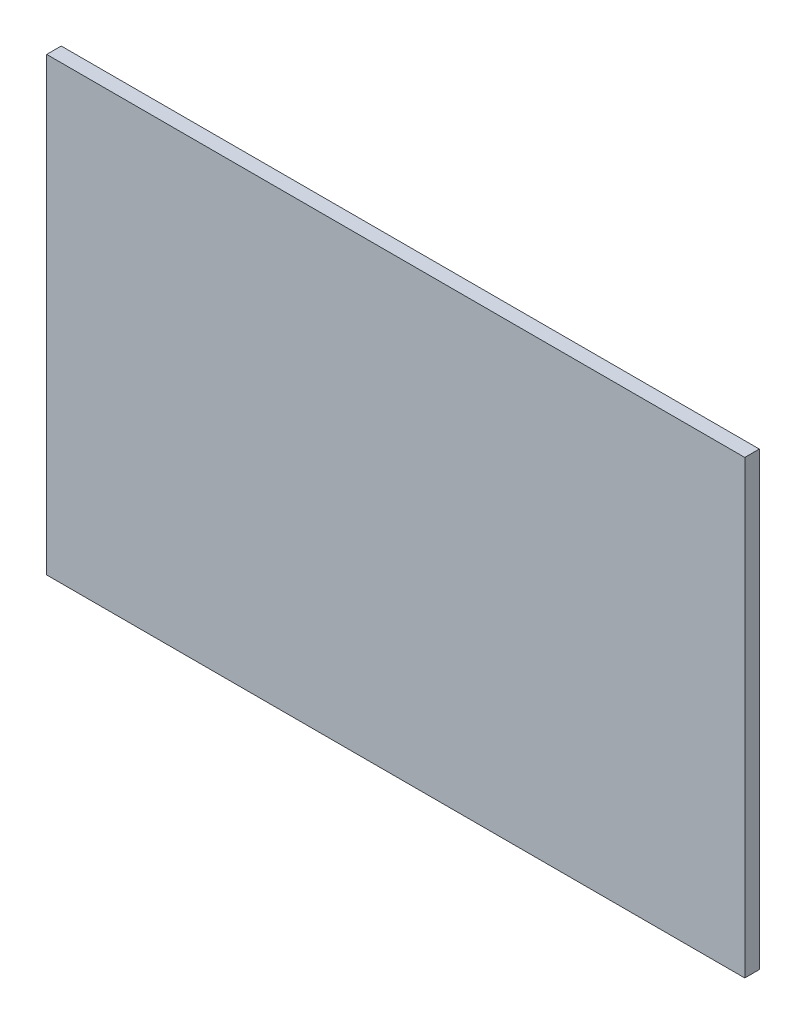
ISO-10303-21;
HEADER;
FILE_DESCRIPTION(('STEP AP214'),'2;1');
FILE_NAME('part.step','',(''),(''),'','','');
FILE_SCHEMA(('AUTOMOTIVE_DESIGN { 1 0 10303 214 1 1 1 1 }'));
ENDSEC;
DATA;
#1=APPLICATION_CONTEXT('core data for automotive mechanical design processes');
#2=APPLICATION_PROTOCOL_DEFINITION('international standard','automotive_design',2000,#1);
#3=PRODUCT_CONTEXT('',#1,'mechanical');
#4=PRODUCT('Part','Part','',(#3));
#5=PRODUCT_RELATED_PRODUCT_CATEGORY('part','',(#4));
#6=PRODUCT_DEFINITION_FORMATION('','',#4);
#7=PRODUCT_DEFINITION_CONTEXT('part definition',#1,'design');
#8=PRODUCT_DEFINITION('design','',#6,#7);
#9=PRODUCT_DEFINITION_SHAPE('','',#8);
#10=(LENGTH_UNIT() NAMED_UNIT(*) SI_UNIT(.MILLI.,.METRE.));
#11=(NAMED_UNIT(*) PLANE_ANGLE_UNIT() SI_UNIT($,.RADIAN.));
#12=(NAMED_UNIT(*) SI_UNIT($,.STERADIAN.) SOLID_ANGLE_UNIT());
#13=UNCERTAINTY_MEASURE_WITH_UNIT(LENGTH_MEASURE(1.E-05),#10,'distance_accuracy_value','');
#14=(GEOMETRIC_REPRESENTATION_CONTEXT(3) GLOBAL_UNCERTAINTY_ASSIGNED_CONTEXT((#13)) GLOBAL_UNIT_ASSIGNED_CONTEXT((#10,
#11,#12)) REPRESENTATION_CONTEXT('',''));
#15=CARTESIAN_POINT('',(0.,0.,0.));
#16=DIRECTION('',(0.,0.,1.));
#17=DIRECTION('',(1.,0.,0.));
#18=AXIS2_PLACEMENT_3D('',#15,#16,#17);
#19=CARTESIAN_POINT('',(-42.6888138682352,28.2641509433962,2.));
#20=DIRECTION('',(1.,0.,0.));
#21=DIRECTION('',(0.,1.,0.));
#22=AXIS2_PLACEMENT_3D('',#19,#20,#21);
#23=PLANE('',#22);
#24=DIRECTION('',(0.,-1.,0.));
#25=VECTOR('',#24,1.);
#26=CARTESIAN_POINT('',(-42.6888138682352,28.2641509433962,0.));
#27=LINE('',#26,#25);
#28=CARTESIAN_POINT('',(-42.6888138682352,28.2641509433962,0.));
#29=VERTEX_POINT('',#28);
#30=CARTESIAN_POINT('',(-42.6888138682352,-33.7358490566038,0.));
#31=VERTEX_POINT('',#30);
#32=EDGE_CURVE('E96',#29,#31,#27,.T.);
#33=ORIENTED_EDGE('',*,*,#32,.T.);
#34=DIRECTION('',(0.,0.,-1.));
#35=VECTOR('',#34,1.);
#36=CARTESIAN_POINT('',(-42.6888138682352,-33.7358490566038,2.));
#37=LINE('',#36,#35);
#38=CARTESIAN_POINT('',(-42.6888138682352,-33.7358490566038,2.));
#39=VERTEX_POINT('',#38);
#40=EDGE_CURVE('E11',#39,#31,#37,.T.);
#41=ORIENTED_EDGE('',*,*,#40,.F.);
#42=DIRECTION('',(0.,-1.,0.));
#43=VECTOR('',#42,1.);
#44=CARTESIAN_POINT('',(-42.6888138682352,28.2641509433962,2.));
#45=LINE('',#44,#43);
#46=CARTESIAN_POINT('',(-42.6888138682352,28.2641509433962,2.));
#47=VERTEX_POINT('',#46);
#48=EDGE_CURVE('E84',#47,#39,#45,.T.);
#49=ORIENTED_EDGE('',*,*,#48,.F.);
#50=DIRECTION('',(0.,0.,-1.));
#51=VECTOR('',#50,1.);
#52=CARTESIAN_POINT('',(-42.6888138682352,28.2641509433962,2.));
#53=LINE('',#52,#51);
#54=EDGE_CURVE('E92',#47,#29,#53,.T.);
#55=ORIENTED_EDGE('',*,*,#54,.T.);
#56=EDGE_LOOP('',(#33,#41,#49,#55));
#57=FACE_BOUND('',#56,.T.);
#58=ADVANCED_FACE('F33',(#57),#23,.F.);
#59=CARTESIAN_POINT('',(-42.6888138682352,-33.7358490566038,2.));
#60=DIRECTION('',(0.,1.,0.));
#61=DIRECTION('',(0.,0.,1.));
#62=AXIS2_PLACEMENT_3D('',#59,#60,#61);
#63=PLANE('',#62);
#64=DIRECTION('',(1.,0.,0.));
#65=VECTOR('',#64,1.);
#66=CARTESIAN_POINT('',(-42.6888138682352,-33.7358490566038,0.));
#67=LINE('',#66,#65);
#68=CARTESIAN_POINT('',(53.3111861317648,-33.7358490566038,0.));
#69=VERTEX_POINT('',#68);
#70=EDGE_CURVE('E88',#31,#69,#67,.T.);
#71=ORIENTED_EDGE('',*,*,#70,.T.);
#72=DIRECTION('',(0.,0.,-1.));
#73=VECTOR('',#72,1.);
#74=CARTESIAN_POINT('',(53.3111861317648,-33.7358490566038,2.));
#75=LINE('',#74,#73);
#76=CARTESIAN_POINT('',(53.3111861317648,-33.7358490566038,2.));
#77=VERTEX_POINT('',#76);
#78=EDGE_CURVE('E41',#77,#69,#75,.T.);
#79=ORIENTED_EDGE('',*,*,#78,.F.);
#80=DIRECTION('',(1.,0.,0.));
#81=VECTOR('',#80,1.);
#82=CARTESIAN_POINT('',(-42.6888138682352,-33.7358490566038,2.));
#83=LINE('',#82,#81);
#84=EDGE_CURVE('E79',#39,#77,#83,.T.);
#85=ORIENTED_EDGE('',*,*,#84,.F.);
#86=ORIENTED_EDGE('',*,*,#40,.T.);
#87=EDGE_LOOP('',(#71,#79,#85,#86));
#88=FACE_BOUND('',#87,.T.);
#89=ADVANCED_FACE('F87',(#88),#63,.F.);
#90=CARTESIAN_POINT('',(53.3111861317648,28.2641509433962,2.));
#91=DIRECTION('',(-1.,0.,0.));
#92=DIRECTION('',(0.,-1.,0.));
#93=AXIS2_PLACEMENT_3D('',#90,#91,#92);
#94=PLANE('',#93);
#95=DIRECTION('',(0.,1.,0.));
#96=VECTOR('',#95,1.);
#97=CARTESIAN_POINT('',(53.3111861317648,28.2641509433962,0.));
#98=LINE('',#97,#96);
#99=CARTESIAN_POINT('',(53.3111861317648,28.2641509433962,0.));
#100=VERTEX_POINT('',#99);
#101=EDGE_CURVE('E66',#69,#100,#98,.T.);
#102=ORIENTED_EDGE('',*,*,#101,.T.);
#103=DIRECTION('',(0.,0.,-1.));
#104=VECTOR('',#103,1.);
#105=CARTESIAN_POINT('',(53.3111861317648,28.2641509433962,2.));
#106=LINE('',#105,#104);
#107=CARTESIAN_POINT('',(53.3111861317648,28.2641509433962,2.));
#108=VERTEX_POINT('',#107);
#109=EDGE_CURVE('E89',#108,#100,#106,.T.);
#110=ORIENTED_EDGE('',*,*,#109,.F.);
#111=DIRECTION('',(0.,1.,0.));
#112=VECTOR('',#111,1.);
#113=CARTESIAN_POINT('',(53.3111861317648,28.2641509433962,2.));
#114=LINE('',#113,#112);
#115=EDGE_CURVE('E82',#77,#108,#114,.T.);
#116=ORIENTED_EDGE('',*,*,#115,.F.);
#117=ORIENTED_EDGE('',*,*,#78,.T.);
#118=EDGE_LOOP('',(#102,#110,#116,#117));
#119=FACE_BOUND('',#118,.T.);
#120=ADVANCED_FACE('F90',(#119),#94,.F.);
#121=CARTESIAN_POINT('',(-42.6888138682352,28.2641509433962,2.));
#122=DIRECTION('',(0.,-1.,0.));
#123=DIRECTION('',(0.,0.,-1.));
#124=AXIS2_PLACEMENT_3D('',#121,#122,#123);
#125=PLANE('',#124);
#126=DIRECTION('',(-1.,0.,0.));
#127=VECTOR('',#126,1.);
#128=CARTESIAN_POINT('',(-42.6888138682352,28.2641509433962,0.));
#129=LINE('',#128,#127);
#130=EDGE_CURVE('E72',#100,#29,#129,.T.);
#131=ORIENTED_EDGE('',*,*,#130,.T.);
#132=ORIENTED_EDGE('',*,*,#54,.F.);
#133=DIRECTION('',(-1.,0.,0.));
#134=VECTOR('',#133,1.);
#135=CARTESIAN_POINT('',(-42.6888138682352,28.2641509433962,2.));
#136=LINE('',#135,#134);
#137=EDGE_CURVE('E49',#108,#47,#136,.T.);
#138=ORIENTED_EDGE('',*,*,#137,.F.);
#139=ORIENTED_EDGE('',*,*,#109,.T.);
#140=EDGE_LOOP('',(#131,#132,#138,#139));
#141=FACE_BOUND('',#140,.T.);
#142=ADVANCED_FACE('F103',(#141),#125,.F.);
#143=CARTESIAN_POINT('',(0.,0.,2.));
#144=DIRECTION('',(0.,0.,1.));
#145=DIRECTION('',(1.,0.,0.));
#146=AXIS2_PLACEMENT_3D('',#143,#144,#145);
#147=PLANE('',#146);
#148=ORIENTED_EDGE('',*,*,#48,.T.);
#149=ORIENTED_EDGE('',*,*,#84,.T.);
#150=ORIENTED_EDGE('',*,*,#115,.T.);
#151=ORIENTED_EDGE('',*,*,#137,.T.);
#152=EDGE_LOOP('',(#148,#149,#150,#151));
#153=FACE_BOUND('',#152,.T.);
#154=ADVANCED_FACE('F80',(#153),#147,.T.);
#155=CARTESIAN_POINT('',(0.,0.,0.));
#156=DIRECTION('',(0.,0.,1.));
#157=DIRECTION('',(1.,0.,0.));
#158=AXIS2_PLACEMENT_3D('',#155,#156,#157);
#159=PLANE('',#158);
#160=ORIENTED_EDGE('',*,*,#32,.F.);
#161=ORIENTED_EDGE('',*,*,#130,.F.);
#162=ORIENTED_EDGE('',*,*,#101,.F.);
#163=ORIENTED_EDGE('',*,*,#70,.F.);
#164=EDGE_LOOP('',(#160,#161,#162,#163));
#165=FACE_BOUND('',#164,.T.);
#166=ADVANCED_FACE('F106',(#165),#159,.F.);
#167=CLOSED_SHELL('',(#58,#89,#120,#142,#154,#166));
#168=MANIFOLD_SOLID_BREP('B2',#167);
#169=ADVANCED_BREP_SHAPE_REPRESENTATION('',(#18,#168),#14);
#170=SHAPE_DEFINITION_REPRESENTATION(#9,#169);
ENDSEC;
END-ISO-10303-21;
